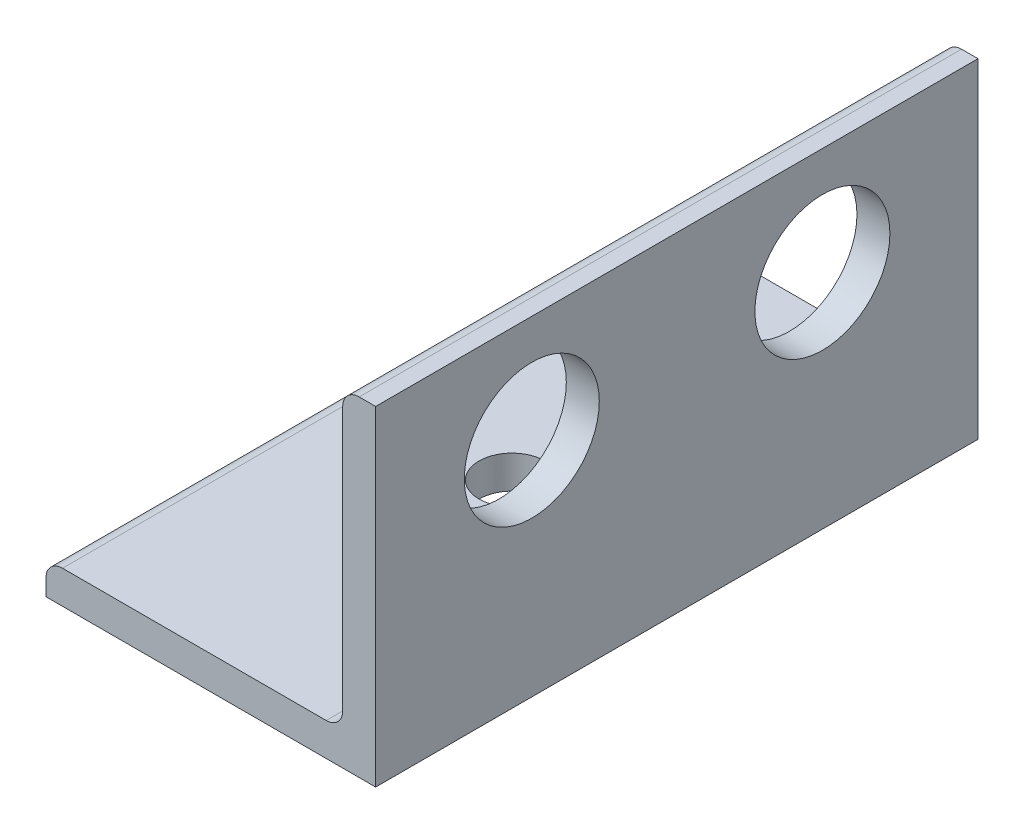
ISO-10303-21;
HEADER;
FILE_DESCRIPTION(('STEP AP214'),'2;1');
FILE_NAME('part.step','',(''),(''),'','','');
FILE_SCHEMA(('AUTOMOTIVE_DESIGN { 1 0 10303 214 1 1 1 1 }'));
ENDSEC;
DATA;
#1=APPLICATION_CONTEXT('core data for automotive mechanical design processes');
#2=APPLICATION_PROTOCOL_DEFINITION('international standard','automotive_design',2000,#1);
#3=PRODUCT_CONTEXT('',#1,'mechanical');
#4=PRODUCT('Part','Part','',(#3));
#5=PRODUCT_RELATED_PRODUCT_CATEGORY('part','',(#4));
#6=PRODUCT_DEFINITION_FORMATION('','',#4);
#7=PRODUCT_DEFINITION_CONTEXT('part definition',#1,'design');
#8=PRODUCT_DEFINITION('design','',#6,#7);
#9=PRODUCT_DEFINITION_SHAPE('','',#8);
#10=(LENGTH_UNIT() NAMED_UNIT(*) SI_UNIT(.MILLI.,.METRE.));
#11=(NAMED_UNIT(*) PLANE_ANGLE_UNIT() SI_UNIT($,.RADIAN.));
#12=(NAMED_UNIT(*) SI_UNIT($,.STERADIAN.) SOLID_ANGLE_UNIT());
#13=UNCERTAINTY_MEASURE_WITH_UNIT(LENGTH_MEASURE(1.E-05),#10,'distance_accuracy_value','');
#14=(GEOMETRIC_REPRESENTATION_CONTEXT(3) GLOBAL_UNCERTAINTY_ASSIGNED_CONTEXT((#13)) GLOBAL_UNIT_ASSIGNED_CONTEXT((#10,
#11,#12)) REPRESENTATION_CONTEXT('',''));
#15=CARTESIAN_POINT('',(0.,0.,0.));
#16=DIRECTION('',(0.,0.,1.));
#17=DIRECTION('',(1.,0.,0.));
#18=AXIS2_PLACEMENT_3D('',#15,#16,#17);
#19=CARTESIAN_POINT('',(-7.9375,0.793749999999998,152.4));
#20=DIRECTION('',(1.,0.,0.));
#21=DIRECTION('',(0.,0.,-1.));
#22=AXIS2_PLACEMENT_3D('',#19,#20,#21);
#23=PLANE('',#22);
#24=DIRECTION('',(0.,0.,-1.));
#25=VECTOR('',#24,1.);
#26=CARTESIAN_POINT('',(-7.9375,0.,152.4));
#27=LINE('',#26,#25);
#28=CARTESIAN_POINT('',(-7.9375,0.,-123.3932));
#29=VERTEX_POINT('',#28);
#30=CARTESIAN_POINT('',(-7.9375,0.,-152.4));
#31=VERTEX_POINT('',#30);
#32=EDGE_CURVE('E11',#29,#31,#27,.T.);
#33=ORIENTED_EDGE('',*,*,#32,.F.);
#34=DIRECTION('',(0.,-1.,0.));
#35=VECTOR('',#34,1.);
#36=CARTESIAN_POINT('',(-7.9375,0.793750000000001,-123.3932));
#37=LINE('',#36,#35);
#38=CARTESIAN_POINT('',(-7.9375,0.793749999999999,-123.3932));
#39=VERTEX_POINT('',#38);
#40=EDGE_CURVE('E100',#39,#29,#37,.T.);
#41=ORIENTED_EDGE('',*,*,#40,.F.);
#42=DIRECTION('',(0.,0.,-1.));
#43=VECTOR('',#42,1.);
#44=CARTESIAN_POINT('',(-7.9375,0.793749999999999,152.4));
#45=LINE('',#44,#43);
#46=CARTESIAN_POINT('',(-7.9375,0.793749999999999,-152.4));
#47=VERTEX_POINT('',#46);
#48=EDGE_CURVE('E54',#39,#47,#45,.T.);
#49=ORIENTED_EDGE('',*,*,#48,.T.);
#50=DIRECTION('',(0.,-1.,0.));
#51=VECTOR('',#50,1.);
#52=CARTESIAN_POINT('',(-7.9375,0.793749999999998,-152.4));
#53=LINE('',#52,#51);
#54=EDGE_CURVE('E117',#47,#31,#53,.T.);
#55=ORIENTED_EDGE('',*,*,#54,.T.);
#56=EDGE_LOOP('',(#33,#41,#49,#55));
#57=FACE_BOUND('',#56,.T.);
#58=ADVANCED_FACE('F32',(#57),#23,.F.);
#59=CARTESIAN_POINT('',(-7.9375,0.,152.4));
#60=DIRECTION('',(0.,1.,0.));
#61=DIRECTION('',(0.,0.,1.));
#62=AXIS2_PLACEMENT_3D('',#59,#60,#61);
#63=PLANE('',#62);
#64=CARTESIAN_POINT('',(0.,0.,-137.8966));
#65=DIRECTION('',(0.,-1.,0.));
#66=DIRECTION('',(0.,0.,-1.));
#67=AXIS2_PLACEMENT_3D('',#64,#65,#66);
#68=CIRCLE('',#67,1.5875);
#69=CARTESIAN_POINT('',(0.,0.,-139.4841));
#70=VERTEX_POINT('',#69);
#71=EDGE_CURVE('E335',#70,#70,#68,.T.);
#72=ORIENTED_EDGE('',*,*,#71,.F.);
#73=EDGE_LOOP('',(#72));
#74=FACE_BOUND('',#73,.T.);
#75=DIRECTION('',(0.,0.,-1.));
#76=VECTOR('',#75,1.);
#77=CARTESIAN_POINT('',(7.9375,0.,152.4));
#78=LINE('',#77,#76);
#79=CARTESIAN_POINT('',(7.9375,0.,-123.3932));
#80=VERTEX_POINT('',#79);
#81=CARTESIAN_POINT('',(7.9375,0.,-152.4));
#82=VERTEX_POINT('',#81);
#83=EDGE_CURVE('E39',#80,#82,#78,.T.);
#84=ORIENTED_EDGE('',*,*,#83,.F.);
#85=DIRECTION('',(1.,0.,0.));
#86=VECTOR('',#85,1.);
#87=CARTESIAN_POINT('',(-7.9375,0.,-123.3932));
#88=LINE('',#87,#86);
#89=EDGE_CURVE('E103',#29,#80,#88,.T.);
#90=ORIENTED_EDGE('',*,*,#89,.F.);
#91=ORIENTED_EDGE('',*,*,#32,.T.);
#92=DIRECTION('',(1.,0.,0.));
#93=VECTOR('',#92,1.);
#94=CARTESIAN_POINT('',(-7.9375,0.,-152.4));
#95=LINE('',#94,#93);
#96=EDGE_CURVE('E120',#31,#82,#95,.T.);
#97=ORIENTED_EDGE('',*,*,#96,.T.);
#98=EDGE_LOOP('',(#84,#90,#91,#97));
#99=FACE_BOUND('',#98,.T.);
#100=ADVANCED_FACE('F111',(#74,#99),#63,.F.);
#101=CARTESIAN_POINT('',(7.9375,0.,152.4));
#102=DIRECTION('',(-1.,0.,0.));
#103=DIRECTION('',(0.,0.,1.));
#104=AXIS2_PLACEMENT_3D('',#101,#102,#103);
#105=PLANE('',#104);
#106=CARTESIAN_POINT('',(7.9375,10.7061,-144.907));
#107=DIRECTION('',(1.,0.,0.));
#108=DIRECTION('',(0.,0.,-1.));
#109=AXIS2_PLACEMENT_3D('',#106,#107,#108);
#110=CIRCLE('',#109,3.25120000000001);
#111=CARTESIAN_POINT('',(7.9375,10.7061,-148.1582));
#112=VERTEX_POINT('',#111);
#113=EDGE_CURVE('E126',#112,#112,#110,.T.);
#114=ORIENTED_EDGE('',*,*,#113,.F.);
#115=EDGE_LOOP('',(#114));
#116=FACE_BOUND('',#115,.T.);
#117=CARTESIAN_POINT('',(7.9375,10.7061,-130.9116));
#118=DIRECTION('',(1.,0.,0.));
#119=DIRECTION('',(0.,0.,-1.));
#120=AXIS2_PLACEMENT_3D('',#117,#118,#119);
#121=CIRCLE('',#120,3.25119999999998);
#122=CARTESIAN_POINT('',(7.9375,10.7061,-134.1628));
#123=VERTEX_POINT('',#122);
#124=EDGE_CURVE('E185',#123,#123,#121,.T.);
#125=ORIENTED_EDGE('',*,*,#124,.F.);
#126=EDGE_LOOP('',(#125));
#127=FACE_BOUND('',#126,.T.);
#128=DIRECTION('',(0.,0.,-1.));
#129=VECTOR('',#128,1.);
#130=CARTESIAN_POINT('',(7.9375,15.875,152.4));
#131=LINE('',#130,#129);
#132=CARTESIAN_POINT('',(7.9375,15.875,-123.3932));
#133=VERTEX_POINT('',#132);
#134=CARTESIAN_POINT('',(7.9375,15.875,-152.4));
#135=VERTEX_POINT('',#134);
#136=EDGE_CURVE('E162',#133,#135,#131,.T.);
#137=ORIENTED_EDGE('',*,*,#136,.F.);
#138=DIRECTION('',(0.,1.,0.));
#139=VECTOR('',#138,1.);
#140=CARTESIAN_POINT('',(7.9375,0.,-123.3932));
#141=LINE('',#140,#139);
#142=EDGE_CURVE('E114',#80,#133,#141,.T.);
#143=ORIENTED_EDGE('',*,*,#142,.F.);
#144=ORIENTED_EDGE('',*,*,#83,.T.);
#145=DIRECTION('',(0.,1.,0.));
#146=VECTOR('',#145,1.);
#147=CARTESIAN_POINT('',(7.9375,0.,-152.4));
#148=LINE('',#147,#146);
#149=EDGE_CURVE('E123',#82,#135,#148,.T.);
#150=ORIENTED_EDGE('',*,*,#149,.T.);
#151=EDGE_LOOP('',(#137,#143,#144,#150));
#152=FACE_BOUND('',#151,.T.);
#153=ADVANCED_FACE('F165',(#116,#127,#152),#105,.F.);
#154=CARTESIAN_POINT('',(7.14375,15.875,152.4));
#155=DIRECTION('',(0.,-1.,0.));
#156=DIRECTION('',(1.,0.,0.));
#157=AXIS2_PLACEMENT_3D('',#154,#155,#156);
#158=PLANE('',#157);
#159=DIRECTION('',(0.,0.,-1.));
#160=VECTOR('',#159,1.);
#161=CARTESIAN_POINT('',(7.14375,15.875,152.4));
#162=LINE('',#161,#160);
#163=CARTESIAN_POINT('',(7.14375,15.875,-123.3932));
#164=VERTEX_POINT('',#163);
#165=CARTESIAN_POINT('',(7.14375,15.875,-152.4));
#166=VERTEX_POINT('',#165);
#167=EDGE_CURVE('E160',#164,#166,#162,.T.);
#168=ORIENTED_EDGE('',*,*,#167,.F.);
#169=DIRECTION('',(-1.,0.,0.));
#170=VECTOR('',#169,1.);
#171=CARTESIAN_POINT('',(7.9375,15.875,-123.3932));
#172=LINE('',#171,#170);
#173=EDGE_CURVE('E175',#133,#164,#172,.T.);
#174=ORIENTED_EDGE('',*,*,#173,.F.);
#175=ORIENTED_EDGE('',*,*,#136,.T.);
#176=DIRECTION('',(-1.,0.,0.));
#177=VECTOR('',#176,1.);
#178=CARTESIAN_POINT('',(7.14375,15.875,-152.4));
#179=LINE('',#178,#177);
#180=EDGE_CURVE('E134',#135,#166,#179,.T.);
#181=ORIENTED_EDGE('',*,*,#180,.T.);
#182=EDGE_LOOP('',(#168,#174,#175,#181));
#183=FACE_BOUND('',#182,.T.);
#184=ADVANCED_FACE('F173',(#183),#158,.F.);
#185=CARTESIAN_POINT('',(7.14375,15.08125,152.4));
#186=DIRECTION('',(0.,0.,-1.));
#187=DIRECTION('',(-1.,0.,0.));
#188=AXIS2_PLACEMENT_3D('',#185,#186,#187);
#189=CYLINDRICAL_SURFACE('',#188,0.793749999999998);
#190=DIRECTION('',(0.,0.,-1.));
#191=VECTOR('',#190,1.);
#192=CARTESIAN_POINT('',(6.35,15.08125,152.4));
#193=LINE('',#192,#191);
#194=CARTESIAN_POINT('',(6.35,15.08125,-123.3932));
#195=VERTEX_POINT('',#194);
#196=CARTESIAN_POINT('',(6.35,15.08125,-152.4));
#197=VERTEX_POINT('',#196);
#198=EDGE_CURVE('E158',#195,#197,#193,.T.);
#199=ORIENTED_EDGE('',*,*,#198,.F.);
#200=CARTESIAN_POINT('',(7.14375,15.08125,-123.3932));
#201=DIRECTION('',(0.,0.,-1.));
#202=DIRECTION('',(0.,1.,0.));
#203=AXIS2_PLACEMENT_3D('',#200,#201,#202);
#204=CIRCLE('',#203,0.793749999999999);
#205=EDGE_CURVE('E177',#164,#195,#204,.F.);
#206=ORIENTED_EDGE('',*,*,#205,.F.);
#207=ORIENTED_EDGE('',*,*,#167,.T.);
#208=CARTESIAN_POINT('',(7.14375,15.08125,-152.4));
#209=DIRECTION('',(0.,0.,1.));
#210=DIRECTION('',(-1.,0.,0.));
#211=AXIS2_PLACEMENT_3D('',#208,#209,#210);
#212=CIRCLE('',#211,0.793749999999998);
#213=EDGE_CURVE('E137',#166,#197,#212,.T.);
#214=ORIENTED_EDGE('',*,*,#213,.T.);
#215=EDGE_LOOP('',(#199,#206,#207,#214));
#216=FACE_BOUND('',#215,.T.);
#217=ADVANCED_FACE('F238',(#216),#189,.T.);
#218=CARTESIAN_POINT('',(6.35,15.08125,152.4));
#219=DIRECTION('',(1.,0.,0.));
#220=DIRECTION('',(0.,1.,0.));
#221=AXIS2_PLACEMENT_3D('',#218,#219,#220);
#222=PLANE('',#221);
#223=CARTESIAN_POINT('',(6.35,10.7061,-144.907));
#224=DIRECTION('',(1.,0.,0.));
#225=DIRECTION('',(0.,1.,0.));
#226=AXIS2_PLACEMENT_3D('',#223,#224,#225);
#227=CIRCLE('',#226,3.25120000000001);
#228=CARTESIAN_POINT('',(6.35,13.9573,-144.907));
#229=VERTEX_POINT('',#228);
#230=EDGE_CURVE('E121',#229,#229,#227,.F.);
#231=ORIENTED_EDGE('',*,*,#230,.F.);
#232=EDGE_LOOP('',(#231));
#233=FACE_BOUND('',#232,.T.);
#234=CARTESIAN_POINT('',(6.35,10.7061,-130.9116));
#235=DIRECTION('',(1.,0.,0.));
#236=DIRECTION('',(0.,1.,0.));
#237=AXIS2_PLACEMENT_3D('',#234,#235,#236);
#238=CIRCLE('',#237,3.25119999999998);
#239=CARTESIAN_POINT('',(6.35,13.9573,-130.9116));
#240=VERTEX_POINT('',#239);
#241=EDGE_CURVE('E129',#240,#240,#238,.F.);
#242=ORIENTED_EDGE('',*,*,#241,.F.);
#243=EDGE_LOOP('',(#242));
#244=FACE_BOUND('',#243,.T.);
#245=DIRECTION('',(0.,0.,-1.));
#246=VECTOR('',#245,1.);
#247=CARTESIAN_POINT('',(6.35,2.38124999999999,152.4));
#248=LINE('',#247,#246);
#249=CARTESIAN_POINT('',(6.35,2.38124999999999,-123.3932));
#250=VERTEX_POINT('',#249);
#251=CARTESIAN_POINT('',(6.35,2.38124999999999,-152.4));
#252=VERTEX_POINT('',#251);
#253=EDGE_CURVE('E156',#250,#252,#248,.T.);
#254=ORIENTED_EDGE('',*,*,#253,.F.);
#255=DIRECTION('',(0.,-1.,0.));
#256=VECTOR('',#255,1.);
#257=CARTESIAN_POINT('',(6.35,15.08125,-123.3932));
#258=LINE('',#257,#256);
#259=EDGE_CURVE('E179',#195,#250,#258,.T.);
#260=ORIENTED_EDGE('',*,*,#259,.F.);
#261=ORIENTED_EDGE('',*,*,#198,.T.);
#262=DIRECTION('',(0.,-1.,0.));
#263=VECTOR('',#262,1.);
#264=CARTESIAN_POINT('',(6.35,15.08125,-152.4));
#265=LINE('',#264,#263);
#266=EDGE_CURVE('E140',#197,#252,#265,.T.);
#267=ORIENTED_EDGE('',*,*,#266,.T.);
#268=EDGE_LOOP('',(#254,#260,#261,#267));
#269=FACE_BOUND('',#268,.T.);
#270=ADVANCED_FACE('F203',(#233,#244,#269),#222,.F.);
#271=CARTESIAN_POINT('',(5.55625000000001,2.38124999999999,152.4));
#272=DIRECTION('',(0.,0.,-1.));
#273=DIRECTION('',(-1.,0.,0.));
#274=AXIS2_PLACEMENT_3D('',#271,#272,#273);
#275=CYLINDRICAL_SURFACE('',#274,0.793749999999998);
#276=DIRECTION('',(0.,0.,-1.));
#277=VECTOR('',#276,1.);
#278=CARTESIAN_POINT('',(5.55625000000001,1.5875,152.4));
#279=LINE('',#278,#277);
#280=CARTESIAN_POINT('',(5.55625000000001,1.5875,-123.3932));
#281=VERTEX_POINT('',#280);
#282=CARTESIAN_POINT('',(5.55625000000001,1.5875,-152.4));
#283=VERTEX_POINT('',#282);
#284=EDGE_CURVE('E154',#281,#283,#279,.T.);
#285=ORIENTED_EDGE('',*,*,#284,.F.);
#286=CARTESIAN_POINT('',(5.55625000000001,2.38124999999999,-123.3932));
#287=DIRECTION('',(0.,0.,-1.));
#288=DIRECTION('',(0.,1.,0.));
#289=AXIS2_PLACEMENT_3D('',#286,#287,#288);
#290=CIRCLE('',#289,0.793749999999999);
#291=EDGE_CURVE('E191',#250,#281,#290,.T.);
#292=ORIENTED_EDGE('',*,*,#291,.F.);
#293=ORIENTED_EDGE('',*,*,#253,.T.);
#294=CARTESIAN_POINT('',(5.55625000000001,2.38124999999999,-152.4));
#295=DIRECTION('',(0.,0.,-1.));
#296=DIRECTION('',(-1.,0.,0.));
#297=AXIS2_PLACEMENT_3D('',#294,#295,#296);
#298=CIRCLE('',#297,0.793749999999998);
#299=EDGE_CURVE('E143',#252,#283,#298,.T.);
#300=ORIENTED_EDGE('',*,*,#299,.T.);
#301=EDGE_LOOP('',(#285,#292,#293,#300));
#302=FACE_BOUND('',#301,.T.);
#303=ADVANCED_FACE('F202',(#302),#275,.F.);
#304=CARTESIAN_POINT('',(5.55625000000001,1.5875,152.4));
#305=DIRECTION('',(0.,-1.,0.));
#306=DIRECTION('',(1.,0.,0.));
#307=AXIS2_PLACEMENT_3D('',#304,#305,#306);
#308=PLANE('',#307);
#309=CARTESIAN_POINT('',(0.,1.5875,-137.8966));
#310=DIRECTION('',(0.,-1.,0.));
#311=DIRECTION('',(1.,0.,0.));
#312=AXIS2_PLACEMENT_3D('',#309,#310,#311);
#313=CIRCLE('',#312,1.5875);
#314=CARTESIAN_POINT('',(1.5875,1.5875,-137.8966));
#315=VERTEX_POINT('',#314);
#316=EDGE_CURVE('E107',#315,#315,#313,.F.);
#317=ORIENTED_EDGE('',*,*,#316,.F.);
#318=EDGE_LOOP('',(#317));
#319=FACE_BOUND('',#318,.T.);
#320=DIRECTION('',(0.,0.,-1.));
#321=VECTOR('',#320,1.);
#322=CARTESIAN_POINT('',(-7.14375,1.5875,152.4));
#323=LINE('',#322,#321);
#324=CARTESIAN_POINT('',(-7.14375,1.5875,-123.3932));
#325=VERTEX_POINT('',#324);
#326=CARTESIAN_POINT('',(-7.14375,1.5875,-152.4));
#327=VERTEX_POINT('',#326);
#328=EDGE_CURVE('E152',#325,#327,#323,.T.);
#329=ORIENTED_EDGE('',*,*,#328,.F.);
#330=DIRECTION('',(-1.,0.,0.));
#331=VECTOR('',#330,1.);
#332=CARTESIAN_POINT('',(5.55625000000001,1.5875,-123.3932));
#333=LINE('',#332,#331);
#334=EDGE_CURVE('E46',#281,#325,#333,.T.);
#335=ORIENTED_EDGE('',*,*,#334,.F.);
#336=ORIENTED_EDGE('',*,*,#284,.T.);
#337=DIRECTION('',(-1.,0.,0.));
#338=VECTOR('',#337,1.);
#339=CARTESIAN_POINT('',(5.55625000000001,1.5875,-152.4));
#340=LINE('',#339,#338);
#341=EDGE_CURVE('E146',#283,#327,#340,.T.);
#342=ORIENTED_EDGE('',*,*,#341,.T.);
#343=EDGE_LOOP('',(#329,#335,#336,#342));
#344=FACE_BOUND('',#343,.T.);
#345=ADVANCED_FACE('F208',(#319,#344),#308,.F.);
#346=CARTESIAN_POINT('',(-7.14375,0.793749999999999,152.4));
#347=DIRECTION('',(0.,0.,-1.));
#348=DIRECTION('',(-1.,0.,0.));
#349=AXIS2_PLACEMENT_3D('',#346,#347,#348);
#350=CYLINDRICAL_SURFACE('',#349,0.793749999999999);
#351=ORIENTED_EDGE('',*,*,#48,.F.);
#352=CARTESIAN_POINT('',(-7.14375,0.793749999999999,-123.3932));
#353=DIRECTION('',(0.,0.,-1.));
#354=DIRECTION('',(0.,1.,0.));
#355=AXIS2_PLACEMENT_3D('',#352,#353,#354);
#356=CIRCLE('',#355,0.793749999999999);
#357=EDGE_CURVE('E105',#325,#39,#356,.F.);
#358=ORIENTED_EDGE('',*,*,#357,.F.);
#359=ORIENTED_EDGE('',*,*,#328,.T.);
#360=CARTESIAN_POINT('',(-7.14375,0.793749999999999,-152.4));
#361=DIRECTION('',(0.,0.,1.));
#362=DIRECTION('',(-1.,0.,0.));
#363=AXIS2_PLACEMENT_3D('',#360,#361,#362);
#364=CIRCLE('',#363,0.793749999999999);
#365=EDGE_CURVE('E149',#327,#47,#364,.T.);
#366=ORIENTED_EDGE('',*,*,#365,.T.);
#367=EDGE_LOOP('',(#351,#358,#359,#366));
#368=FACE_BOUND('',#367,.T.);
#369=ADVANCED_FACE('F210',(#368),#350,.T.);
#370=CARTESIAN_POINT('',(7.14375,15.08125,-152.4));
#371=DIRECTION('',(0.,0.,-1.));
#372=DIRECTION('',(-1.,0.,0.));
#373=AXIS2_PLACEMENT_3D('',#370,#371,#372);
#374=PLANE('',#373);
#375=ORIENTED_EDGE('',*,*,#54,.F.);
#376=ORIENTED_EDGE('',*,*,#365,.F.);
#377=ORIENTED_EDGE('',*,*,#341,.F.);
#378=ORIENTED_EDGE('',*,*,#299,.F.);
#379=ORIENTED_EDGE('',*,*,#266,.F.);
#380=ORIENTED_EDGE('',*,*,#213,.F.);
#381=ORIENTED_EDGE('',*,*,#180,.F.);
#382=ORIENTED_EDGE('',*,*,#149,.F.);
#383=ORIENTED_EDGE('',*,*,#96,.F.);
#384=EDGE_LOOP('',(#375,#376,#377,#378,#379,#380,#381,#382,#383));
#385=FACE_BOUND('',#384,.T.);
#386=ADVANCED_FACE('F168',(#385),#374,.T.);
#387=CARTESIAN_POINT('',(-7.9385,10.7061,-130.9116));
#388=DIRECTION('',(1.,0.,0.));
#389=DIRECTION('',(0.,0.,-1.));
#390=AXIS2_PLACEMENT_3D('',#387,#388,#389);
#391=CYLINDRICAL_SURFACE('',#390,3.25119999999998);
#392=ORIENTED_EDGE('',*,*,#124,.T.);
#393=EDGE_LOOP('',(#392));
#394=FACE_BOUND('',#393,.T.);
#395=ORIENTED_EDGE('',*,*,#241,.T.);
#396=EDGE_LOOP('',(#395));
#397=FACE_BOUND('',#396,.T.);
#398=ADVANCED_FACE('F218',(#394,#397),#391,.F.);
#399=CARTESIAN_POINT('',(-7.9385,10.7061,-144.907));
#400=DIRECTION('',(1.,0.,0.));
#401=DIRECTION('',(0.,0.,-1.));
#402=AXIS2_PLACEMENT_3D('',#399,#400,#401);
#403=CYLINDRICAL_SURFACE('',#402,3.25120000000001);
#404=ORIENTED_EDGE('',*,*,#113,.T.);
#405=EDGE_LOOP('',(#404));
#406=FACE_BOUND('',#405,.T.);
#407=ORIENTED_EDGE('',*,*,#230,.T.);
#408=EDGE_LOOP('',(#407));
#409=FACE_BOUND('',#408,.T.);
#410=ADVANCED_FACE('F303',(#406,#409),#403,.F.);
#411=CARTESIAN_POINT('',(10.9347,20.447,-123.3932));
#412=DIRECTION('',(0.,0.,-1.));
#413=DIRECTION('',(0.,1.,0.));
#414=AXIS2_PLACEMENT_3D('',#411,#412,#413);
#415=PLANE('',#414);
#416=ORIENTED_EDGE('',*,*,#357,.T.);
#417=ORIENTED_EDGE('',*,*,#40,.T.);
#418=ORIENTED_EDGE('',*,*,#89,.T.);
#419=ORIENTED_EDGE('',*,*,#142,.T.);
#420=ORIENTED_EDGE('',*,*,#173,.T.);
#421=ORIENTED_EDGE('',*,*,#205,.T.);
#422=ORIENTED_EDGE('',*,*,#259,.T.);
#423=ORIENTED_EDGE('',*,*,#291,.T.);
#424=ORIENTED_EDGE('',*,*,#334,.T.);
#425=EDGE_LOOP('',(#416,#417,#418,#419,#420,#421,#422,#423,#424));
#426=FACE_BOUND('',#425,.T.);
#427=ADVANCED_FACE('F102',(#426),#415,.F.);
#428=CARTESIAN_POINT('',(0.,15.876,-137.8966));
#429=DIRECTION('',(0.,-1.,0.));
#430=DIRECTION('',(0.,0.,-1.));
#431=AXIS2_PLACEMENT_3D('',#428,#429,#430);
#432=CYLINDRICAL_SURFACE('',#431,1.5875);
#433=ORIENTED_EDGE('',*,*,#71,.T.);
#434=EDGE_LOOP('',(#433));
#435=FACE_BOUND('',#434,.T.);
#436=ORIENTED_EDGE('',*,*,#316,.T.);
#437=EDGE_LOOP('',(#436));
#438=FACE_BOUND('',#437,.T.);
#439=ADVANCED_FACE('F317',(#435,#438),#432,.F.);
#440=CLOSED_SHELL('',(#58,#100,#153,#184,#217,#270,#303,#345,#369,#386,#398,#410,#427,#439));
#441=MANIFOLD_SOLID_BREP('B2',#440);
#442=ADVANCED_BREP_SHAPE_REPRESENTATION('',(#18,#441),#14);
#443=SHAPE_DEFINITION_REPRESENTATION(#9,#442);
ENDSEC;
END-ISO-10303-21;
